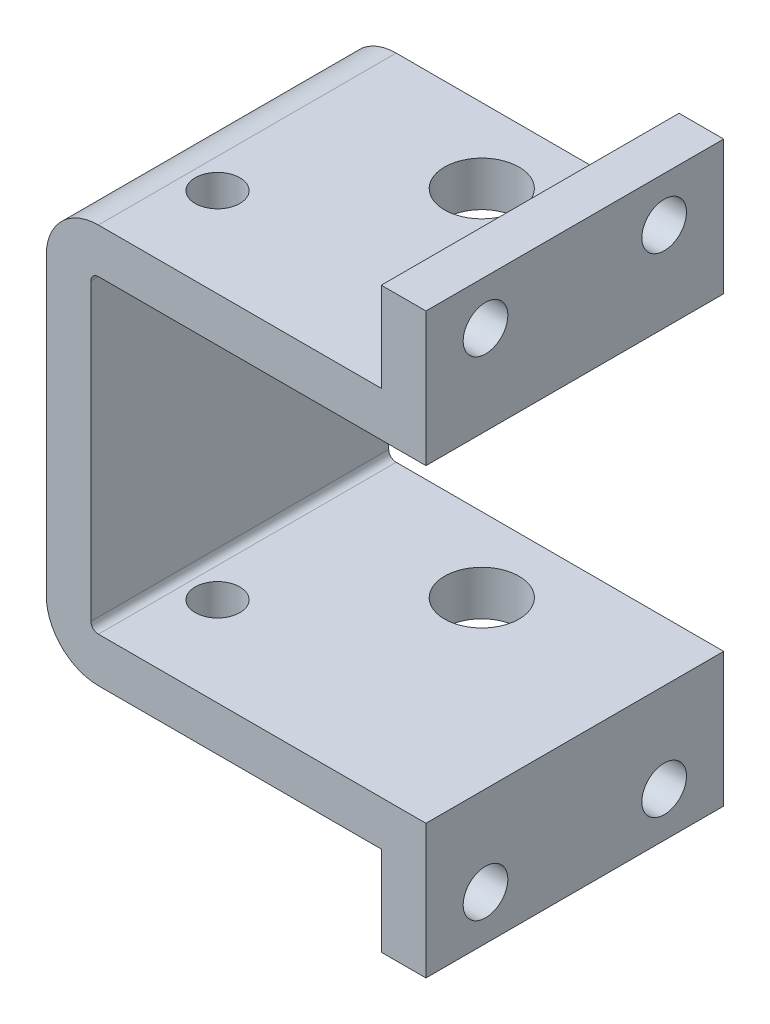
ISO-10303-21;
HEADER;
FILE_DESCRIPTION(('STEP AP214'),'2;1');
FILE_NAME('part.step','',(''),(''),'','','');
FILE_SCHEMA(('AUTOMOTIVE_DESIGN { 1 0 10303 214 1 1 1 1 }'));
ENDSEC;
DATA;
#1=APPLICATION_CONTEXT('core data for automotive mechanical design processes');
#2=APPLICATION_PROTOCOL_DEFINITION('international standard','automotive_design',2000,#1);
#3=PRODUCT_CONTEXT('',#1,'mechanical');
#4=PRODUCT('Part','Part','',(#3));
#5=PRODUCT_RELATED_PRODUCT_CATEGORY('part','',(#4));
#6=PRODUCT_DEFINITION_FORMATION('','',#4);
#7=PRODUCT_DEFINITION_CONTEXT('part definition',#1,'design');
#8=PRODUCT_DEFINITION('design','',#6,#7);
#9=PRODUCT_DEFINITION_SHAPE('','',#8);
#10=(LENGTH_UNIT() NAMED_UNIT(*) SI_UNIT(.MILLI.,.METRE.));
#11=(NAMED_UNIT(*) PLANE_ANGLE_UNIT() SI_UNIT($,.RADIAN.));
#12=(NAMED_UNIT(*) SI_UNIT($,.STERADIAN.) SOLID_ANGLE_UNIT());
#13=UNCERTAINTY_MEASURE_WITH_UNIT(LENGTH_MEASURE(1.E-05),#10,'distance_accuracy_value','');
#14=(GEOMETRIC_REPRESENTATION_CONTEXT(3) GLOBAL_UNCERTAINTY_ASSIGNED_CONTEXT((#13)) GLOBAL_UNIT_ASSIGNED_CONTEXT((#10,
#11,#12)) REPRESENTATION_CONTEXT('',''));
#15=CARTESIAN_POINT('',(0.,0.,0.));
#16=DIRECTION('',(0.,0.,1.));
#17=DIRECTION('',(1.,0.,0.));
#18=AXIS2_PLACEMENT_3D('',#15,#16,#17);
#19=CARTESIAN_POINT('',(20.9832921811959,10.4,20.));
#20=DIRECTION('',(-1.,0.,0.));
#21=DIRECTION('',(0.,0.,1.));
#22=AXIS2_PLACEMENT_3D('',#19,#20,#21);
#23=PLANE('',#22);
#24=CARTESIAN_POINT('',(20.9832921811959,16.3999999999999,4.));
#25=DIRECTION('',(-1.,0.,0.));
#26=DIRECTION('',(0.,0.,1.));
#27=AXIS2_PLACEMENT_3D('',#24,#25,#26);
#28=CIRCLE('',#27,1.5);
#29=CARTESIAN_POINT('',(20.9832921811959,16.3999999999999,5.50000000000001));
#30=VERTEX_POINT('',#29);
#31=EDGE_CURVE('E261',#30,#30,#28,.T.);
#32=ORIENTED_EDGE('',*,*,#31,.T.);
#33=EDGE_LOOP('',(#32));
#34=FACE_BOUND('',#33,.T.);
#35=CARTESIAN_POINT('',(20.9832921811959,16.3999999999999,16.));
#36=DIRECTION('',(-1.,0.,0.));
#37=DIRECTION('',(0.,0.,1.));
#38=AXIS2_PLACEMENT_3D('',#35,#36,#37);
#39=CIRCLE('',#38,1.5);
#40=CARTESIAN_POINT('',(20.9832921811959,16.3999999999999,17.5));
#41=VERTEX_POINT('',#40);
#42=EDGE_CURVE('E278',#41,#41,#39,.T.);
#43=ORIENTED_EDGE('',*,*,#42,.T.);
#44=EDGE_LOOP('',(#43));
#45=FACE_BOUND('',#44,.T.);
#46=DIRECTION('',(0.,1.,0.));
#47=VECTOR('',#46,1.);
#48=CARTESIAN_POINT('',(20.9832921811959,10.4,0.));
#49=LINE('',#48,#47);
#50=CARTESIAN_POINT('',(20.9832921811959,10.4,0.));
#51=VERTEX_POINT('',#50);
#52=CARTESIAN_POINT('',(20.9832921811959,19.3999999999999,0.));
#53=VERTEX_POINT('',#52);
#54=EDGE_CURVE('E179',#51,#53,#49,.T.);
#55=ORIENTED_EDGE('',*,*,#54,.T.);
#56=DIRECTION('',(0.,0.,-1.));
#57=VECTOR('',#56,1.);
#58=CARTESIAN_POINT('',(20.9832921811959,19.3999999999999,20.));
#59=LINE('',#58,#57);
#60=CARTESIAN_POINT('',(20.9832921811959,19.3999999999999,20.));
#61=VERTEX_POINT('',#60);
#62=EDGE_CURVE('E11',#61,#53,#59,.T.);
#63=ORIENTED_EDGE('',*,*,#62,.F.);
#64=DIRECTION('',(0.,1.,0.));
#65=VECTOR('',#64,1.);
#66=CARTESIAN_POINT('',(20.9832921811959,10.4,20.));
#67=LINE('',#66,#65);
#68=CARTESIAN_POINT('',(20.9832921811959,10.4,20.));
#69=VERTEX_POINT('',#68);
#70=EDGE_CURVE('E210',#69,#61,#67,.T.);
#71=ORIENTED_EDGE('',*,*,#70,.F.);
#72=DIRECTION('',(0.,0.,-1.));
#73=VECTOR('',#72,1.);
#74=CARTESIAN_POINT('',(20.9832921811959,10.4,20.));
#75=LINE('',#74,#73);
#76=EDGE_CURVE('E175',#69,#51,#75,.T.);
#77=ORIENTED_EDGE('',*,*,#76,.T.);
#78=EDGE_LOOP('',(#55,#63,#71,#77));
#79=FACE_BOUND('',#78,.T.);
#80=ADVANCED_FACE('F33',(#34,#45,#79),#23,.F.);
#81=CARTESIAN_POINT('',(20.9832921811959,19.3999999999999,20.));
#82=DIRECTION('',(0.,-1.,0.));
#83=DIRECTION('',(0.,0.,-1.));
#84=AXIS2_PLACEMENT_3D('',#81,#82,#83);
#85=PLANE('',#84);
#86=DIRECTION('',(-1.,0.,0.));
#87=VECTOR('',#86,1.);
#88=CARTESIAN_POINT('',(20.9832921811959,19.3999999999999,0.));
#89=LINE('',#88,#87);
#90=CARTESIAN_POINT('',(17.9832921811959,19.3999999999999,0.));
#91=VERTEX_POINT('',#90);
#92=EDGE_CURVE('E182',#53,#91,#89,.T.);
#93=ORIENTED_EDGE('',*,*,#92,.T.);
#94=DIRECTION('',(0.,0.,-1.));
#95=VECTOR('',#94,1.);
#96=CARTESIAN_POINT('',(17.9832921811959,19.3999999999999,20.));
#97=LINE('',#96,#95);
#98=CARTESIAN_POINT('',(17.9832921811959,19.3999999999999,20.));
#99=VERTEX_POINT('',#98);
#100=EDGE_CURVE('E42',#99,#91,#97,.T.);
#101=ORIENTED_EDGE('',*,*,#100,.F.);
#102=DIRECTION('',(-1.,0.,0.));
#103=VECTOR('',#102,1.);
#104=CARTESIAN_POINT('',(20.9832921811959,19.3999999999999,20.));
#105=LINE('',#104,#103);
#106=EDGE_CURVE('E118',#61,#99,#105,.T.);
#107=ORIENTED_EDGE('',*,*,#106,.F.);
#108=ORIENTED_EDGE('',*,*,#62,.T.);
#109=EDGE_LOOP('',(#93,#101,#107,#108));
#110=FACE_BOUND('',#109,.T.);
#111=ADVANCED_FACE('F345',(#110),#85,.F.);
#112=CARTESIAN_POINT('',(17.9832921811959,19.3999999999999,20.));
#113=DIRECTION('',(1.,0.,0.));
#114=DIRECTION('',(0.,0.,-1.));
#115=AXIS2_PLACEMENT_3D('',#112,#113,#114);
#116=PLANE('',#115);
#117=CARTESIAN_POINT('',(17.9832921811959,16.3999999999999,4.));
#118=DIRECTION('',(-1.,0.,0.));
#119=DIRECTION('',(0.,0.,-1.));
#120=AXIS2_PLACEMENT_3D('',#117,#118,#119);
#121=CIRCLE('',#120,1.5);
#122=CARTESIAN_POINT('',(17.9832921811959,16.3999999999999,2.5));
#123=VERTEX_POINT('',#122);
#124=EDGE_CURVE('E257',#123,#123,#121,.T.);
#125=ORIENTED_EDGE('',*,*,#124,.F.);
#126=EDGE_LOOP('',(#125));
#127=FACE_BOUND('',#126,.T.);
#128=CARTESIAN_POINT('',(17.9832921811959,16.3999999999999,16.));
#129=DIRECTION('',(-1.,0.,0.));
#130=DIRECTION('',(0.,0.,1.));
#131=AXIS2_PLACEMENT_3D('',#128,#129,#130);
#132=CIRCLE('',#131,1.5);
#133=CARTESIAN_POINT('',(17.9832921811959,16.3999999999999,17.5));
#134=VERTEX_POINT('',#133);
#135=EDGE_CURVE('E275',#134,#134,#132,.T.);
#136=ORIENTED_EDGE('',*,*,#135,.F.);
#137=EDGE_LOOP('',(#136));
#138=FACE_BOUND('',#137,.T.);
#139=DIRECTION('',(0.,-1.,0.));
#140=VECTOR('',#139,1.);
#141=CARTESIAN_POINT('',(17.9832921811959,19.3999999999999,0.));
#142=LINE('',#141,#140);
#143=CARTESIAN_POINT('',(17.9832921811959,13.3999999999999,0.));
#144=VERTEX_POINT('',#143);
#145=EDGE_CURVE('E185',#91,#144,#142,.T.);
#146=ORIENTED_EDGE('',*,*,#145,.T.);
#147=DIRECTION('',(0.,0.,-1.));
#148=VECTOR('',#147,1.);
#149=CARTESIAN_POINT('',(17.9832921811959,13.3999999999999,20.));
#150=LINE('',#149,#148);
#151=CARTESIAN_POINT('',(17.9832921811959,13.3999999999999,20.));
#152=VERTEX_POINT('',#151);
#153=EDGE_CURVE('E241',#152,#144,#150,.T.);
#154=ORIENTED_EDGE('',*,*,#153,.F.);
#155=DIRECTION('',(0.,-1.,0.));
#156=VECTOR('',#155,1.);
#157=CARTESIAN_POINT('',(17.9832921811959,19.3999999999999,20.));
#158=LINE('',#157,#156);
#159=EDGE_CURVE('E296',#99,#152,#158,.T.);
#160=ORIENTED_EDGE('',*,*,#159,.F.);
#161=ORIENTED_EDGE('',*,*,#100,.T.);
#162=EDGE_LOOP('',(#146,#154,#160,#161));
#163=FACE_BOUND('',#162,.T.);
#164=ADVANCED_FACE('F350',(#127,#138,#163),#116,.F.);
#165=CARTESIAN_POINT('',(-1.01670781880414,13.3999999999999,20.));
#166=DIRECTION('',(0.,-1.,0.));
#167=DIRECTION('',(1.,0.,0.));
#168=AXIS2_PLACEMENT_3D('',#165,#166,#167);
#169=PLANE('',#168);
#170=CARTESIAN_POINT('',(9.73329218119587,13.3999999999999,5.));
#171=DIRECTION('',(0.,1.,0.));
#172=DIRECTION('',(-1.,0.,0.));
#173=AXIS2_PLACEMENT_3D('',#170,#171,#172);
#174=CIRCLE('',#173,2.5);
#175=CARTESIAN_POINT('',(7.23329218119587,13.3999999999999,5.));
#176=VERTEX_POINT('',#175);
#177=EDGE_CURVE('E254',#176,#176,#174,.T.);
#178=ORIENTED_EDGE('',*,*,#177,.F.);
#179=EDGE_LOOP('',(#178));
#180=FACE_BOUND('',#179,.T.);
#181=CARTESIAN_POINT('',(0.983292181195861,13.3999999999999,14.));
#182=DIRECTION('',(0.,1.,0.));
#183=DIRECTION('',(-1.,0.,0.));
#184=AXIS2_PLACEMENT_3D('',#181,#182,#183);
#185=CIRCLE('',#184,1.5);
#186=CARTESIAN_POINT('',(-0.516707818804138,13.3999999999999,14.));
#187=VERTEX_POINT('',#186);
#188=EDGE_CURVE('E250',#187,#187,#185,.T.);
#189=ORIENTED_EDGE('',*,*,#188,.F.);
#190=EDGE_LOOP('',(#189));
#191=FACE_BOUND('',#190,.T.);
#192=DIRECTION('',(-1.,0.,0.));
#193=VECTOR('',#192,1.);
#194=CARTESIAN_POINT('',(-1.01670781880414,13.3999999999999,0.));
#195=LINE('',#194,#193);
#196=CARTESIAN_POINT('',(-1.01670781880414,13.4,0.));
#197=VERTEX_POINT('',#196);
#198=EDGE_CURVE('E187',#144,#197,#195,.T.);
#199=ORIENTED_EDGE('',*,*,#198,.T.);
#200=DIRECTION('',(0.,0.,-1.));
#201=VECTOR('',#200,1.);
#202=CARTESIAN_POINT('',(-1.01670781880414,13.4,20.));
#203=LINE('',#202,#201);
#204=CARTESIAN_POINT('',(-1.01670781880414,13.4,20.));
#205=VERTEX_POINT('',#204);
#206=EDGE_CURVE('E238',#205,#197,#203,.T.);
#207=ORIENTED_EDGE('',*,*,#206,.F.);
#208=DIRECTION('',(-1.,0.,0.));
#209=VECTOR('',#208,1.);
#210=CARTESIAN_POINT('',(-1.01670781880414,13.3999999999999,20.));
#211=LINE('',#210,#209);
#212=EDGE_CURVE('E298',#152,#205,#211,.T.);
#213=ORIENTED_EDGE('',*,*,#212,.F.);
#214=ORIENTED_EDGE('',*,*,#153,.T.);
#215=EDGE_LOOP('',(#199,#207,#213,#214));
#216=FACE_BOUND('',#215,.T.);
#217=ADVANCED_FACE('F388',(#180,#191,#216),#169,.F.);
#218=CARTESIAN_POINT('',(-1.01670781880414,9.9,20.));
#219=DIRECTION('',(0.,0.,-1.));
#220=DIRECTION('',(-1.,0.,0.));
#221=AXIS2_PLACEMENT_3D('',#218,#219,#220);
#222=CYLINDRICAL_SURFACE('',#221,3.49999999999996);
#223=CARTESIAN_POINT('',(-1.01670781880414,9.9,0.));
#224=DIRECTION('',(0.,0.,1.));
#225=DIRECTION('',(-1.,0.,0.));
#226=AXIS2_PLACEMENT_3D('',#223,#224,#225);
#227=CIRCLE('',#226,3.49999999999996);
#228=CARTESIAN_POINT('',(-4.51670781880414,9.9,0.));
#229=VERTEX_POINT('',#228);
#230=EDGE_CURVE('E189',#197,#229,#227,.T.);
#231=ORIENTED_EDGE('',*,*,#230,.T.);
#232=DIRECTION('',(0.,0.,-1.));
#233=VECTOR('',#232,1.);
#234=CARTESIAN_POINT('',(-4.51670781880414,9.9,20.));
#235=LINE('',#234,#233);
#236=CARTESIAN_POINT('',(-4.51670781880414,9.9,20.));
#237=VERTEX_POINT('',#236);
#238=EDGE_CURVE('E235',#237,#229,#235,.T.);
#239=ORIENTED_EDGE('',*,*,#238,.F.);
#240=CARTESIAN_POINT('',(-1.01670781880414,9.9,20.));
#241=DIRECTION('',(0.,0.,1.));
#242=DIRECTION('',(-1.,0.,0.));
#243=AXIS2_PLACEMENT_3D('',#240,#241,#242);
#244=CIRCLE('',#243,3.49999999999996);
#245=EDGE_CURVE('E300',#205,#237,#244,.T.);
#246=ORIENTED_EDGE('',*,*,#245,.F.);
#247=ORIENTED_EDGE('',*,*,#206,.T.);
#248=EDGE_LOOP('',(#231,#239,#246,#247));
#249=FACE_BOUND('',#248,.T.);
#250=ADVANCED_FACE('F391',(#249),#222,.T.);
#251=CARTESIAN_POINT('',(-4.51670781880414,-9.9,20.));
#252=DIRECTION('',(1.,0.,0.));
#253=DIRECTION('',(0.,0.,-1.));
#254=AXIS2_PLACEMENT_3D('',#251,#252,#253);
#255=PLANE('',#254);
#256=DIRECTION('',(0.,-1.,0.));
#257=VECTOR('',#256,1.);
#258=CARTESIAN_POINT('',(-4.51670781880414,-9.9,0.));
#259=LINE('',#258,#257);
#260=CARTESIAN_POINT('',(-4.5167078188041,-9.9,0.));
#261=VERTEX_POINT('',#260);
#262=EDGE_CURVE('E191',#229,#261,#259,.T.);
#263=ORIENTED_EDGE('',*,*,#262,.T.);
#264=DIRECTION('',(0.,0.,-1.));
#265=VECTOR('',#264,1.);
#266=CARTESIAN_POINT('',(-4.5167078188041,-9.9,20.));
#267=LINE('',#266,#265);
#268=CARTESIAN_POINT('',(-4.5167078188041,-9.9,20.));
#269=VERTEX_POINT('',#268);
#270=EDGE_CURVE('E232',#269,#261,#267,.T.);
#271=ORIENTED_EDGE('',*,*,#270,.F.);
#272=DIRECTION('',(0.,-1.,0.));
#273=VECTOR('',#272,1.);
#274=CARTESIAN_POINT('',(-4.51670781880414,-9.9,20.));
#275=LINE('',#274,#273);
#276=EDGE_CURVE('E302',#237,#269,#275,.T.);
#277=ORIENTED_EDGE('',*,*,#276,.F.);
#278=ORIENTED_EDGE('',*,*,#238,.T.);
#279=EDGE_LOOP('',(#263,#271,#277,#278));
#280=FACE_BOUND('',#279,.T.);
#281=ADVANCED_FACE('F407',(#280),#255,.F.);
#282=CARTESIAN_POINT('',(-1.01670781880414,-9.9,20.));
#283=DIRECTION('',(0.,0.,-1.));
#284=DIRECTION('',(-1.,0.,0.));
#285=AXIS2_PLACEMENT_3D('',#282,#283,#284);
#286=CYLINDRICAL_SURFACE('',#285,3.49999999999996);
#287=CARTESIAN_POINT('',(-1.01670781880414,-9.9,0.));
#288=DIRECTION('',(0.,0.,1.));
#289=DIRECTION('',(-1.,0.,0.));
#290=AXIS2_PLACEMENT_3D('',#287,#288,#289);
#291=CIRCLE('',#290,3.49999999999996);
#292=CARTESIAN_POINT('',(-1.01670781880414,-13.3999999999999,0.));
#293=VERTEX_POINT('',#292);
#294=EDGE_CURVE('E193',#261,#293,#291,.T.);
#295=ORIENTED_EDGE('',*,*,#294,.T.);
#296=DIRECTION('',(0.,0.,-1.));
#297=VECTOR('',#296,1.);
#298=CARTESIAN_POINT('',(-1.01670781880414,-13.3999999999999,20.));
#299=LINE('',#298,#297);
#300=CARTESIAN_POINT('',(-1.01670781880414,-13.3999999999999,20.));
#301=VERTEX_POINT('',#300);
#302=EDGE_CURVE('E229',#301,#293,#299,.T.);
#303=ORIENTED_EDGE('',*,*,#302,.F.);
#304=CARTESIAN_POINT('',(-1.01670781880414,-9.9,20.));
#305=DIRECTION('',(0.,0.,1.));
#306=DIRECTION('',(-1.,0.,0.));
#307=AXIS2_PLACEMENT_3D('',#304,#305,#306);
#308=CIRCLE('',#307,3.49999999999996);
#309=EDGE_CURVE('E304',#269,#301,#308,.T.);
#310=ORIENTED_EDGE('',*,*,#309,.F.);
#311=ORIENTED_EDGE('',*,*,#270,.T.);
#312=EDGE_LOOP('',(#295,#303,#310,#311));
#313=FACE_BOUND('',#312,.T.);
#314=ADVANCED_FACE('F411',(#313),#286,.T.);
#315=CARTESIAN_POINT('',(-1.01670781880414,-13.3999999999999,20.));
#316=DIRECTION('',(0.,1.,0.));
#317=DIRECTION('',(0.,0.,1.));
#318=AXIS2_PLACEMENT_3D('',#315,#316,#317);
#319=PLANE('',#318);
#320=CARTESIAN_POINT('',(9.73329218119587,-13.3999999999999,5.));
#321=DIRECTION('',(0.,1.,0.));
#322=DIRECTION('',(0.,0.,1.));
#323=AXIS2_PLACEMENT_3D('',#320,#321,#322);
#324=CIRCLE('',#323,2.5);
#325=CARTESIAN_POINT('',(9.73329218119587,-13.3999999999999,7.5));
#326=VERTEX_POINT('',#325);
#327=EDGE_CURVE('E285',#326,#326,#324,.T.);
#328=ORIENTED_EDGE('',*,*,#327,.T.);
#329=EDGE_LOOP('',(#328));
#330=FACE_BOUND('',#329,.T.);
#331=CARTESIAN_POINT('',(0.983292181195864,-13.3999999999999,14.));
#332=DIRECTION('',(0.,1.,0.));
#333=DIRECTION('',(0.,0.,1.));
#334=AXIS2_PLACEMENT_3D('',#331,#332,#333);
#335=CIRCLE('',#334,1.5);
#336=CARTESIAN_POINT('',(0.983292181195864,-13.3999999999999,15.5));
#337=VERTEX_POINT('',#336);
#338=EDGE_CURVE('E183',#337,#337,#335,.T.);
#339=ORIENTED_EDGE('',*,*,#338,.T.);
#340=EDGE_LOOP('',(#339));
#341=FACE_BOUND('',#340,.T.);
#342=DIRECTION('',(1.,0.,0.));
#343=VECTOR('',#342,1.);
#344=CARTESIAN_POINT('',(-1.01670781880414,-13.3999999999999,0.));
#345=LINE('',#344,#343);
#346=CARTESIAN_POINT('',(17.9832921811959,-13.3999999999999,0.));
#347=VERTEX_POINT('',#346);
#348=EDGE_CURVE('E195',#293,#347,#345,.T.);
#349=ORIENTED_EDGE('',*,*,#348,.T.);
#350=DIRECTION('',(0.,0.,-1.));
#351=VECTOR('',#350,1.);
#352=CARTESIAN_POINT('',(17.9832921811959,-13.3999999999999,20.));
#353=LINE('',#352,#351);
#354=CARTESIAN_POINT('',(17.9832921811959,-13.3999999999999,20.));
#355=VERTEX_POINT('',#354);
#356=EDGE_CURVE('E226',#355,#347,#353,.T.);
#357=ORIENTED_EDGE('',*,*,#356,.F.);
#358=DIRECTION('',(1.,0.,0.));
#359=VECTOR('',#358,1.);
#360=CARTESIAN_POINT('',(-1.01670781880414,-13.3999999999999,20.));
#361=LINE('',#360,#359);
#362=EDGE_CURVE('E306',#301,#355,#361,.T.);
#363=ORIENTED_EDGE('',*,*,#362,.F.);
#364=ORIENTED_EDGE('',*,*,#302,.T.);
#365=EDGE_LOOP('',(#349,#357,#363,#364));
#366=FACE_BOUND('',#365,.T.);
#367=ADVANCED_FACE('F430',(#330,#341,#366),#319,.F.);
#368=CARTESIAN_POINT('',(17.9832921811959,-19.3999999999999,20.));
#369=DIRECTION('',(1.,0.,0.));
#370=DIRECTION('',(0.,0.,-1.));
#371=AXIS2_PLACEMENT_3D('',#368,#369,#370);
#372=PLANE('',#371);
#373=CARTESIAN_POINT('',(17.9832921811959,-16.3999999999999,4.));
#374=DIRECTION('',(-1.,0.,0.));
#375=DIRECTION('',(0.,0.,1.));
#376=AXIS2_PLACEMENT_3D('',#373,#374,#375);
#377=CIRCLE('',#376,1.5);
#378=CARTESIAN_POINT('',(17.9832921811959,-16.3999999999999,5.50000000000001));
#379=VERTEX_POINT('',#378);
#380=EDGE_CURVE('E263',#379,#379,#377,.T.);
#381=ORIENTED_EDGE('',*,*,#380,.F.);
#382=EDGE_LOOP('',(#381));
#383=FACE_BOUND('',#382,.T.);
#384=CARTESIAN_POINT('',(17.9832921811959,-16.3999999999999,16.));
#385=DIRECTION('',(-1.,0.,0.));
#386=DIRECTION('',(0.,0.,-1.));
#387=AXIS2_PLACEMENT_3D('',#384,#385,#386);
#388=CIRCLE('',#387,1.5);
#389=CARTESIAN_POINT('',(17.9832921811959,-16.3999999999999,14.5));
#390=VERTEX_POINT('',#389);
#391=EDGE_CURVE('E268',#390,#390,#388,.T.);
#392=ORIENTED_EDGE('',*,*,#391,.F.);
#393=EDGE_LOOP('',(#392));
#394=FACE_BOUND('',#393,.T.);
#395=DIRECTION('',(0.,-1.,0.));
#396=VECTOR('',#395,1.);
#397=CARTESIAN_POINT('',(17.9832921811959,-19.3999999999999,0.));
#398=LINE('',#397,#396);
#399=CARTESIAN_POINT('',(17.9832921811959,-19.3999999999999,0.));
#400=VERTEX_POINT('',#399);
#401=EDGE_CURVE('E197',#347,#400,#398,.T.);
#402=ORIENTED_EDGE('',*,*,#401,.T.);
#403=DIRECTION('',(0.,0.,-1.));
#404=VECTOR('',#403,1.);
#405=CARTESIAN_POINT('',(17.9832921811959,-19.3999999999999,20.));
#406=LINE('',#405,#404);
#407=CARTESIAN_POINT('',(17.9832921811959,-19.3999999999999,20.));
#408=VERTEX_POINT('',#407);
#409=EDGE_CURVE('E223',#408,#400,#406,.T.);
#410=ORIENTED_EDGE('',*,*,#409,.F.);
#411=DIRECTION('',(0.,-1.,0.));
#412=VECTOR('',#411,1.);
#413=CARTESIAN_POINT('',(17.9832921811959,-19.3999999999999,20.));
#414=LINE('',#413,#412);
#415=EDGE_CURVE('E308',#355,#408,#414,.T.);
#416=ORIENTED_EDGE('',*,*,#415,.F.);
#417=ORIENTED_EDGE('',*,*,#356,.T.);
#418=EDGE_LOOP('',(#402,#410,#416,#417));
#419=FACE_BOUND('',#418,.T.);
#420=ADVANCED_FACE('F433',(#383,#394,#419),#372,.F.);
#421=CARTESIAN_POINT('',(20.9832921811959,-19.3999999999999,20.));
#422=DIRECTION('',(0.,1.,0.));
#423=DIRECTION('',(0.,0.,1.));
#424=AXIS2_PLACEMENT_3D('',#421,#422,#423);
#425=PLANE('',#424);
#426=DIRECTION('',(1.,0.,0.));
#427=VECTOR('',#426,1.);
#428=CARTESIAN_POINT('',(20.9832921811959,-19.3999999999999,0.));
#429=LINE('',#428,#427);
#430=CARTESIAN_POINT('',(20.9832921811959,-19.3999999999999,0.));
#431=VERTEX_POINT('',#430);
#432=EDGE_CURVE('E199',#400,#431,#429,.T.);
#433=ORIENTED_EDGE('',*,*,#432,.T.);
#434=DIRECTION('',(0.,0.,-1.));
#435=VECTOR('',#434,1.);
#436=CARTESIAN_POINT('',(20.9832921811959,-19.3999999999999,20.));
#437=LINE('',#436,#435);
#438=CARTESIAN_POINT('',(20.9832921811959,-19.3999999999999,20.));
#439=VERTEX_POINT('',#438);
#440=EDGE_CURVE('E220',#439,#431,#437,.T.);
#441=ORIENTED_EDGE('',*,*,#440,.F.);
#442=DIRECTION('',(1.,0.,0.));
#443=VECTOR('',#442,1.);
#444=CARTESIAN_POINT('',(20.9832921811959,-19.3999999999999,20.));
#445=LINE('',#444,#443);
#446=EDGE_CURVE('E310',#408,#439,#445,.T.);
#447=ORIENTED_EDGE('',*,*,#446,.F.);
#448=ORIENTED_EDGE('',*,*,#409,.T.);
#449=EDGE_LOOP('',(#433,#441,#447,#448));
#450=FACE_BOUND('',#449,.T.);
#451=ADVANCED_FACE('F437',(#450),#425,.F.);
#452=CARTESIAN_POINT('',(20.9832921811959,-10.4,20.));
#453=DIRECTION('',(-1.,0.,0.));
#454=DIRECTION('',(0.,0.,1.));
#455=AXIS2_PLACEMENT_3D('',#452,#453,#454);
#456=PLANE('',#455);
#457=CARTESIAN_POINT('',(20.9832921811959,-16.3999999999999,4.));
#458=DIRECTION('',(-1.,0.,0.));
#459=DIRECTION('',(0.,0.,1.));
#460=AXIS2_PLACEMENT_3D('',#457,#458,#459);
#461=CIRCLE('',#460,1.5);
#462=CARTESIAN_POINT('',(20.9832921811959,-16.3999999999999,5.50000000000001));
#463=VERTEX_POINT('',#462);
#464=EDGE_CURVE('E36',#463,#463,#461,.T.);
#465=ORIENTED_EDGE('',*,*,#464,.T.);
#466=EDGE_LOOP('',(#465));
#467=FACE_BOUND('',#466,.T.);
#468=CARTESIAN_POINT('',(20.9832921811959,-16.3999999999999,16.));
#469=DIRECTION('',(-1.,0.,0.));
#470=DIRECTION('',(0.,0.,1.));
#471=AXIS2_PLACEMENT_3D('',#468,#469,#470);
#472=CIRCLE('',#471,1.5);
#473=CARTESIAN_POINT('',(20.9832921811959,-16.3999999999999,17.5));
#474=VERTEX_POINT('',#473);
#475=EDGE_CURVE('E255',#474,#474,#472,.T.);
#476=ORIENTED_EDGE('',*,*,#475,.T.);
#477=EDGE_LOOP('',(#476));
#478=FACE_BOUND('',#477,.T.);
#479=DIRECTION('',(0.,1.,0.));
#480=VECTOR('',#479,1.);
#481=CARTESIAN_POINT('',(20.9832921811959,-10.4,0.));
#482=LINE('',#481,#480);
#483=CARTESIAN_POINT('',(20.9832921811959,-10.4,0.));
#484=VERTEX_POINT('',#483);
#485=EDGE_CURVE('E201',#431,#484,#482,.T.);
#486=ORIENTED_EDGE('',*,*,#485,.T.);
#487=DIRECTION('',(0.,0.,-1.));
#488=VECTOR('',#487,1.);
#489=CARTESIAN_POINT('',(20.9832921811959,-10.4,20.));
#490=LINE('',#489,#488);
#491=CARTESIAN_POINT('',(20.9832921811959,-10.4,20.));
#492=VERTEX_POINT('',#491);
#493=EDGE_CURVE('E217',#492,#484,#490,.T.);
#494=ORIENTED_EDGE('',*,*,#493,.F.);
#495=DIRECTION('',(0.,1.,0.));
#496=VECTOR('',#495,1.);
#497=CARTESIAN_POINT('',(20.9832921811959,-10.4,20.));
#498=LINE('',#497,#496);
#499=EDGE_CURVE('E312',#439,#492,#498,.T.);
#500=ORIENTED_EDGE('',*,*,#499,.F.);
#501=ORIENTED_EDGE('',*,*,#440,.T.);
#502=EDGE_LOOP('',(#486,#494,#500,#501));
#503=FACE_BOUND('',#502,.T.);
#504=ADVANCED_FACE('F441',(#467,#478,#503),#456,.F.);
#505=CARTESIAN_POINT('',(-1.01670781880414,-10.4,20.));
#506=DIRECTION('',(0.,-1.,0.));
#507=DIRECTION('',(1.,0.,0.));
#508=AXIS2_PLACEMENT_3D('',#505,#506,#507);
#509=PLANE('',#508);
#510=CARTESIAN_POINT('',(9.73329218119587,-10.4,5.));
#511=DIRECTION('',(0.,-1.,0.));
#512=DIRECTION('',(1.,0.,0.));
#513=AXIS2_PLACEMENT_3D('',#510,#511,#512);
#514=CIRCLE('',#513,2.5);
#515=CARTESIAN_POINT('',(12.2332921811959,-10.4,5.));
#516=VERTEX_POINT('',#515);
#517=EDGE_CURVE('E253',#516,#516,#514,.T.);
#518=ORIENTED_EDGE('',*,*,#517,.T.);
#519=EDGE_LOOP('',(#518));
#520=FACE_BOUND('',#519,.T.);
#521=CARTESIAN_POINT('',(0.983292181195864,-10.4,14.));
#522=DIRECTION('',(0.,-1.,0.));
#523=DIRECTION('',(1.,0.,0.));
#524=AXIS2_PLACEMENT_3D('',#521,#522,#523);
#525=CIRCLE('',#524,1.5);
#526=CARTESIAN_POINT('',(2.48329218119586,-10.4,14.));
#527=VERTEX_POINT('',#526);
#528=EDGE_CURVE('E249',#527,#527,#525,.T.);
#529=ORIENTED_EDGE('',*,*,#528,.T.);
#530=EDGE_LOOP('',(#529));
#531=FACE_BOUND('',#530,.T.);
#532=DIRECTION('',(-1.,0.,0.));
#533=VECTOR('',#532,1.);
#534=CARTESIAN_POINT('',(-1.01670781880414,-10.4,0.));
#535=LINE('',#534,#533);
#536=CARTESIAN_POINT('',(-1.01670781880414,-10.4,0.));
#537=VERTEX_POINT('',#536);
#538=EDGE_CURVE('E203',#484,#537,#535,.T.);
#539=ORIENTED_EDGE('',*,*,#538,.T.);
#540=DIRECTION('',(0.,0.,-1.));
#541=VECTOR('',#540,1.);
#542=CARTESIAN_POINT('',(-1.01670781880414,-10.4,20.));
#543=LINE('',#542,#541);
#544=CARTESIAN_POINT('',(-1.01670781880414,-10.4,20.));
#545=VERTEX_POINT('',#544);
#546=EDGE_CURVE('E214',#545,#537,#543,.T.);
#547=ORIENTED_EDGE('',*,*,#546,.F.);
#548=DIRECTION('',(-1.,0.,0.));
#549=VECTOR('',#548,1.);
#550=CARTESIAN_POINT('',(-1.01670781880414,-10.4,20.));
#551=LINE('',#550,#549);
#552=EDGE_CURVE('E314',#492,#545,#551,.T.);
#553=ORIENTED_EDGE('',*,*,#552,.F.);
#554=ORIENTED_EDGE('',*,*,#493,.T.);
#555=EDGE_LOOP('',(#539,#547,#553,#554));
#556=FACE_BOUND('',#555,.T.);
#557=ADVANCED_FACE('F320',(#520,#531,#556),#509,.F.);
#558=CARTESIAN_POINT('',(-1.01670781880414,-9.9,20.));
#559=DIRECTION('',(0.,0.,-1.));
#560=DIRECTION('',(-1.,0.,0.));
#561=AXIS2_PLACEMENT_3D('',#558,#559,#560);
#562=CYLINDRICAL_SURFACE('',#561,0.5);
#563=CARTESIAN_POINT('',(-1.01670781880414,-9.9,0.));
#564=DIRECTION('',(0.,0.,-1.));
#565=DIRECTION('',(-1.,0.,0.));
#566=AXIS2_PLACEMENT_3D('',#563,#564,#565);
#567=CIRCLE('',#566,0.5);
#568=CARTESIAN_POINT('',(-1.51670781880414,-9.9,0.));
#569=VERTEX_POINT('',#568);
#570=EDGE_CURVE('E205',#537,#569,#567,.T.);
#571=ORIENTED_EDGE('',*,*,#570,.T.);
#572=DIRECTION('',(0.,0.,-1.));
#573=VECTOR('',#572,1.);
#574=CARTESIAN_POINT('',(-1.51670781880414,-9.9,20.));
#575=LINE('',#574,#573);
#576=CARTESIAN_POINT('',(-1.51670781880414,-9.9,20.));
#577=VERTEX_POINT('',#576);
#578=EDGE_CURVE('E170',#577,#569,#575,.T.);
#579=ORIENTED_EDGE('',*,*,#578,.F.);
#580=CARTESIAN_POINT('',(-1.01670781880414,-9.9,20.));
#581=DIRECTION('',(0.,0.,-1.));
#582=DIRECTION('',(-1.,0.,0.));
#583=AXIS2_PLACEMENT_3D('',#580,#581,#582);
#584=CIRCLE('',#583,0.5);
#585=EDGE_CURVE('E161',#545,#577,#584,.T.);
#586=ORIENTED_EDGE('',*,*,#585,.F.);
#587=ORIENTED_EDGE('',*,*,#546,.T.);
#588=EDGE_LOOP('',(#571,#579,#586,#587));
#589=FACE_BOUND('',#588,.T.);
#590=ADVANCED_FACE('F324',(#589),#562,.F.);
#591=CARTESIAN_POINT('',(-1.51670781880414,-9.9,20.));
#592=DIRECTION('',(-1.,0.,0.));
#593=DIRECTION('',(0.,-1.,0.));
#594=AXIS2_PLACEMENT_3D('',#591,#592,#593);
#595=PLANE('',#594);
#596=DIRECTION('',(0.,1.,0.));
#597=VECTOR('',#596,1.);
#598=CARTESIAN_POINT('',(-1.51670781880414,-9.9,0.));
#599=LINE('',#598,#597);
#600=CARTESIAN_POINT('',(-1.51670781880414,9.9,0.));
#601=VERTEX_POINT('',#600);
#602=EDGE_CURVE('E169',#569,#601,#599,.T.);
#603=ORIENTED_EDGE('',*,*,#602,.T.);
#604=DIRECTION('',(0.,0.,-1.));
#605=VECTOR('',#604,1.);
#606=CARTESIAN_POINT('',(-1.51670781880414,9.9,20.));
#607=LINE('',#606,#605);
#608=CARTESIAN_POINT('',(-1.51670781880414,9.9,20.));
#609=VERTEX_POINT('',#608);
#610=EDGE_CURVE('E166',#609,#601,#607,.T.);
#611=ORIENTED_EDGE('',*,*,#610,.F.);
#612=DIRECTION('',(0.,1.,0.));
#613=VECTOR('',#612,1.);
#614=CARTESIAN_POINT('',(-1.51670781880414,-9.9,20.));
#615=LINE('',#614,#613);
#616=EDGE_CURVE('E155',#577,#609,#615,.T.);
#617=ORIENTED_EDGE('',*,*,#616,.F.);
#618=ORIENTED_EDGE('',*,*,#578,.T.);
#619=EDGE_LOOP('',(#603,#611,#617,#618));
#620=FACE_BOUND('',#619,.T.);
#621=ADVANCED_FACE('F167',(#620),#595,.F.);
#622=CARTESIAN_POINT('',(-1.01670781880414,9.9,20.));
#623=DIRECTION('',(0.,0.,-1.));
#624=DIRECTION('',(-1.,0.,0.));
#625=AXIS2_PLACEMENT_3D('',#622,#623,#624);
#626=CYLINDRICAL_SURFACE('',#625,0.5);
#627=CARTESIAN_POINT('',(-1.01670781880414,9.9,0.));
#628=DIRECTION('',(0.,0.,-1.));
#629=DIRECTION('',(-1.,0.,0.));
#630=AXIS2_PLACEMENT_3D('',#627,#628,#629);
#631=CIRCLE('',#630,0.5);
#632=CARTESIAN_POINT('',(-1.01670781880414,10.4,0.));
#633=VERTEX_POINT('',#632);
#634=EDGE_CURVE('E104',#601,#633,#631,.T.);
#635=ORIENTED_EDGE('',*,*,#634,.T.);
#636=DIRECTION('',(0.,0.,-1.));
#637=VECTOR('',#636,1.);
#638=CARTESIAN_POINT('',(-1.01670781880414,10.4,20.));
#639=LINE('',#638,#637);
#640=CARTESIAN_POINT('',(-1.01670781880414,10.4,20.));
#641=VERTEX_POINT('',#640);
#642=EDGE_CURVE('E171',#641,#633,#639,.T.);
#643=ORIENTED_EDGE('',*,*,#642,.F.);
#644=CARTESIAN_POINT('',(-1.01670781880414,9.9,20.));
#645=DIRECTION('',(0.,0.,-1.));
#646=DIRECTION('',(-1.,0.,0.));
#647=AXIS2_PLACEMENT_3D('',#644,#645,#646);
#648=CIRCLE('',#647,0.5);
#649=EDGE_CURVE('E159',#609,#641,#648,.T.);
#650=ORIENTED_EDGE('',*,*,#649,.F.);
#651=ORIENTED_EDGE('',*,*,#610,.T.);
#652=EDGE_LOOP('',(#635,#643,#650,#651));
#653=FACE_BOUND('',#652,.T.);
#654=ADVANCED_FACE('F173',(#653),#626,.F.);
#655=CARTESIAN_POINT('',(-1.01670781880414,10.4,20.));
#656=DIRECTION('',(0.,1.,0.));
#657=DIRECTION('',(-1.,0.,0.));
#658=AXIS2_PLACEMENT_3D('',#655,#656,#657);
#659=PLANE('',#658);
#660=CARTESIAN_POINT('',(9.73329218119587,10.4,5.));
#661=DIRECTION('',(0.,1.,0.));
#662=DIRECTION('',(-1.,0.,0.));
#663=AXIS2_PLACEMENT_3D('',#660,#661,#662);
#664=CIRCLE('',#663,2.5);
#665=CARTESIAN_POINT('',(7.23329218119587,10.4,5.));
#666=VERTEX_POINT('',#665);
#667=EDGE_CURVE('E251',#666,#666,#664,.T.);
#668=ORIENTED_EDGE('',*,*,#667,.T.);
#669=EDGE_LOOP('',(#668));
#670=FACE_BOUND('',#669,.T.);
#671=CARTESIAN_POINT('',(0.983292181195862,10.4,14.));
#672=DIRECTION('',(0.,1.,0.));
#673=DIRECTION('',(-1.,0.,0.));
#674=AXIS2_PLACEMENT_3D('',#671,#672,#673);
#675=CIRCLE('',#674,1.5);
#676=CARTESIAN_POINT('',(-0.516707818804138,10.4,14.));
#677=VERTEX_POINT('',#676);
#678=EDGE_CURVE('E246',#677,#677,#675,.T.);
#679=ORIENTED_EDGE('',*,*,#678,.T.);
#680=EDGE_LOOP('',(#679));
#681=FACE_BOUND('',#680,.T.);
#682=DIRECTION('',(1.,0.,0.));
#683=VECTOR('',#682,1.);
#684=CARTESIAN_POINT('',(-1.01670781880414,10.4,0.));
#685=LINE('',#684,#683);
#686=EDGE_CURVE('E110',#633,#51,#685,.T.);
#687=ORIENTED_EDGE('',*,*,#686,.T.);
#688=ORIENTED_EDGE('',*,*,#76,.F.);
#689=DIRECTION('',(1.,0.,0.));
#690=VECTOR('',#689,1.);
#691=CARTESIAN_POINT('',(-1.01670781880414,10.4,20.));
#692=LINE('',#691,#690);
#693=EDGE_CURVE('E51',#641,#69,#692,.T.);
#694=ORIENTED_EDGE('',*,*,#693,.F.);
#695=ORIENTED_EDGE('',*,*,#642,.T.);
#696=EDGE_LOOP('',(#687,#688,#694,#695));
#697=FACE_BOUND('',#696,.T.);
#698=ADVANCED_FACE('F332',(#670,#681,#697),#659,.F.);
#699=CARTESIAN_POINT('',(-1.01670781880414,9.9,20.));
#700=DIRECTION('',(0.,0.,-1.));
#701=DIRECTION('',(-1.,0.,0.));
#702=AXIS2_PLACEMENT_3D('',#699,#700,#701);
#703=PLANE('',#702);
#704=ORIENTED_EDGE('',*,*,#70,.T.);
#705=ORIENTED_EDGE('',*,*,#106,.T.);
#706=ORIENTED_EDGE('',*,*,#159,.T.);
#707=ORIENTED_EDGE('',*,*,#212,.T.);
#708=ORIENTED_EDGE('',*,*,#245,.T.);
#709=ORIENTED_EDGE('',*,*,#276,.T.);
#710=ORIENTED_EDGE('',*,*,#309,.T.);
#711=ORIENTED_EDGE('',*,*,#362,.T.);
#712=ORIENTED_EDGE('',*,*,#415,.T.);
#713=ORIENTED_EDGE('',*,*,#446,.T.);
#714=ORIENTED_EDGE('',*,*,#499,.T.);
#715=ORIENTED_EDGE('',*,*,#552,.T.);
#716=ORIENTED_EDGE('',*,*,#585,.T.);
#717=ORIENTED_EDGE('',*,*,#616,.T.);
#718=ORIENTED_EDGE('',*,*,#649,.T.);
#719=ORIENTED_EDGE('',*,*,#693,.T.);
#720=EDGE_LOOP('',(#704,#705,#706,#707,#708,#709,#710,#711,#712,#713,#714,#715,#716,#717,#718,#719));
#721=FACE_BOUND('',#720,.T.);
#722=ADVANCED_FACE('F157',(#721),#703,.F.);
#723=CARTESIAN_POINT('',(-1.01670781880414,9.9,0.));
#724=DIRECTION('',(0.,0.,-1.));
#725=DIRECTION('',(-1.,0.,0.));
#726=AXIS2_PLACEMENT_3D('',#723,#724,#725);
#727=PLANE('',#726);
#728=ORIENTED_EDGE('',*,*,#54,.F.);
#729=ORIENTED_EDGE('',*,*,#686,.F.);
#730=ORIENTED_EDGE('',*,*,#634,.F.);
#731=ORIENTED_EDGE('',*,*,#602,.F.);
#732=ORIENTED_EDGE('',*,*,#570,.F.);
#733=ORIENTED_EDGE('',*,*,#538,.F.);
#734=ORIENTED_EDGE('',*,*,#485,.F.);
#735=ORIENTED_EDGE('',*,*,#432,.F.);
#736=ORIENTED_EDGE('',*,*,#401,.F.);
#737=ORIENTED_EDGE('',*,*,#348,.F.);
#738=ORIENTED_EDGE('',*,*,#294,.F.);
#739=ORIENTED_EDGE('',*,*,#262,.F.);
#740=ORIENTED_EDGE('',*,*,#230,.F.);
#741=ORIENTED_EDGE('',*,*,#198,.F.);
#742=ORIENTED_EDGE('',*,*,#145,.F.);
#743=ORIENTED_EDGE('',*,*,#92,.F.);
#744=EDGE_LOOP('',(#728,#729,#730,#731,#732,#733,#734,#735,#736,#737,#738,#739,#740,#741,#742,#743));
#745=FACE_BOUND('',#744,.T.);
#746=ADVANCED_FACE('F327',(#745),#727,.T.);
#747=CARTESIAN_POINT('',(0.983292181195864,-13.6000000000001,14.));
#748=DIRECTION('',(0.,1.,0.));
#749=DIRECTION('',(-1.,0.,0.));
#750=AXIS2_PLACEMENT_3D('',#747,#748,#749);
#751=CYLINDRICAL_SURFACE('',#750,1.5);
#752=ORIENTED_EDGE('',*,*,#188,.T.);
#753=EDGE_LOOP('',(#752));
#754=FACE_BOUND('',#753,.T.);
#755=ORIENTED_EDGE('',*,*,#678,.F.);
#756=EDGE_LOOP('',(#755));
#757=FACE_BOUND('',#756,.T.);
#758=ADVANCED_FACE('F375',(#754,#757),#751,.F.);
#759=ORIENTED_EDGE('',*,*,#528,.F.);
#760=EDGE_LOOP('',(#759));
#761=FACE_BOUND('',#760,.T.);
#762=ORIENTED_EDGE('',*,*,#338,.F.);
#763=EDGE_LOOP('',(#762));
#764=FACE_BOUND('',#763,.T.);
#765=ADVANCED_FACE('F373',(#761,#764),#751,.F.);
#766=CARTESIAN_POINT('',(9.73329218119587,-13.6000000000001,5.));
#767=DIRECTION('',(0.,1.,0.));
#768=DIRECTION('',(-1.,0.,0.));
#769=AXIS2_PLACEMENT_3D('',#766,#767,#768);
#770=CYLINDRICAL_SURFACE('',#769,2.5);
#771=ORIENTED_EDGE('',*,*,#177,.T.);
#772=EDGE_LOOP('',(#771));
#773=FACE_BOUND('',#772,.T.);
#774=ORIENTED_EDGE('',*,*,#667,.F.);
#775=EDGE_LOOP('',(#774));
#776=FACE_BOUND('',#775,.T.);
#777=ADVANCED_FACE('F368',(#773,#776),#770,.F.);
#778=ORIENTED_EDGE('',*,*,#517,.F.);
#779=EDGE_LOOP('',(#778));
#780=FACE_BOUND('',#779,.T.);
#781=ORIENTED_EDGE('',*,*,#327,.F.);
#782=EDGE_LOOP('',(#781));
#783=FACE_BOUND('',#782,.T.);
#784=ADVANCED_FACE('F358',(#780,#783),#770,.F.);
#785=CARTESIAN_POINT('',(44.9832921811959,16.3999999999999,16.));
#786=DIRECTION('',(-1.,0.,0.));
#787=DIRECTION('',(0.,0.,1.));
#788=AXIS2_PLACEMENT_3D('',#785,#786,#787);
#789=CYLINDRICAL_SURFACE('',#788,1.5);
#790=ORIENTED_EDGE('',*,*,#135,.T.);
#791=EDGE_LOOP('',(#790));
#792=FACE_BOUND('',#791,.T.);
#793=ORIENTED_EDGE('',*,*,#42,.F.);
#794=EDGE_LOOP('',(#793));
#795=FACE_BOUND('',#794,.T.);
#796=ADVANCED_FACE('F355',(#792,#795),#789,.F.);
#797=CARTESIAN_POINT('',(44.9832921811959,-16.3999999999999,16.));
#798=DIRECTION('',(-1.,0.,0.));
#799=DIRECTION('',(0.,0.,1.));
#800=AXIS2_PLACEMENT_3D('',#797,#798,#799);
#801=CYLINDRICAL_SURFACE('',#800,1.5);
#802=ORIENTED_EDGE('',*,*,#391,.T.);
#803=EDGE_LOOP('',(#802));
#804=FACE_BOUND('',#803,.T.);
#805=ORIENTED_EDGE('',*,*,#475,.F.);
#806=EDGE_LOOP('',(#805));
#807=FACE_BOUND('',#806,.T.);
#808=ADVANCED_FACE('F357',(#804,#807),#801,.F.);
#809=CARTESIAN_POINT('',(44.9832921811959,-16.3999999999999,4.));
#810=DIRECTION('',(-1.,0.,0.));
#811=DIRECTION('',(0.,0.,1.));
#812=AXIS2_PLACEMENT_3D('',#809,#810,#811);
#813=CYLINDRICAL_SURFACE('',#812,1.5);
#814=ORIENTED_EDGE('',*,*,#380,.T.);
#815=EDGE_LOOP('',(#814));
#816=FACE_BOUND('',#815,.T.);
#817=ORIENTED_EDGE('',*,*,#464,.F.);
#818=EDGE_LOOP('',(#817));
#819=FACE_BOUND('',#818,.T.);
#820=ADVANCED_FACE('F365',(#816,#819),#813,.F.);
#821=CARTESIAN_POINT('',(44.9832921811959,16.3999999999999,4.));
#822=DIRECTION('',(-1.,0.,0.));
#823=DIRECTION('',(0.,0.,1.));
#824=AXIS2_PLACEMENT_3D('',#821,#822,#823);
#825=CYLINDRICAL_SURFACE('',#824,1.5);
#826=ORIENTED_EDGE('',*,*,#124,.T.);
#827=EDGE_LOOP('',(#826));
#828=FACE_BOUND('',#827,.T.);
#829=ORIENTED_EDGE('',*,*,#31,.F.);
#830=EDGE_LOOP('',(#829));
#831=FACE_BOUND('',#830,.T.);
#832=ADVANCED_FACE('F560',(#828,#831),#825,.F.);
#833=CLOSED_SHELL('',(#80,#111,#164,#217,#250,#281,#314,#367,#420,#451,#504,#557,#590,#621,#654,
#698,#722,#746,#758,#765,#777,#784,#796,#808,#820,#832));
#834=MANIFOLD_SOLID_BREP('B2',#833);
#835=ADVANCED_BREP_SHAPE_REPRESENTATION('',(#18,#834),#14);
#836=SHAPE_DEFINITION_REPRESENTATION(#9,#835);
ENDSEC;
END-ISO-10303-21;
